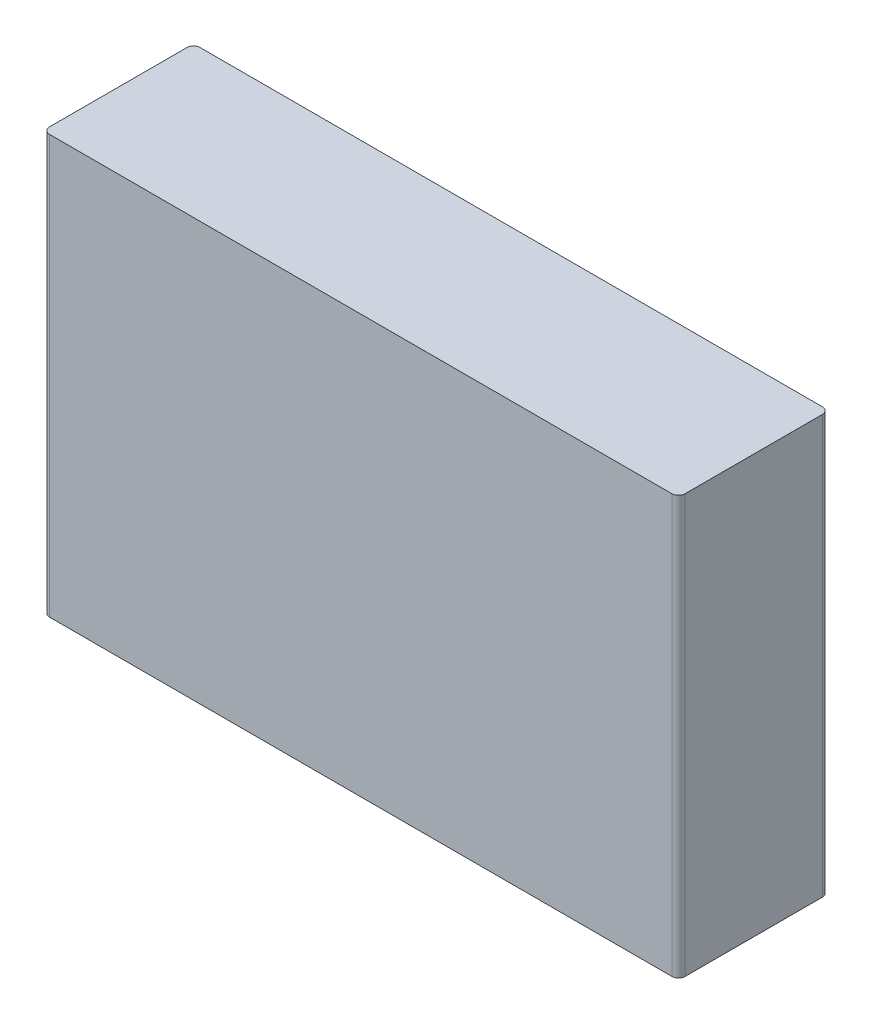
ISO-10303-21;
HEADER;
FILE_DESCRIPTION(('STEP AP214'),'2;1');
FILE_NAME('part.step','',(''),(''),'','','');
FILE_SCHEMA(('AUTOMOTIVE_DESIGN { 1 0 10303 214 1 1 1 1 }'));
ENDSEC;
DATA;
#1=APPLICATION_CONTEXT('core data for automotive mechanical design processes');
#2=APPLICATION_PROTOCOL_DEFINITION('international standard','automotive_design',2000,#1);
#3=PRODUCT_CONTEXT('',#1,'mechanical');
#4=PRODUCT('Part','Part','',(#3));
#5=PRODUCT_RELATED_PRODUCT_CATEGORY('part','',(#4));
#6=PRODUCT_DEFINITION_FORMATION('','',#4);
#7=PRODUCT_DEFINITION_CONTEXT('part definition',#1,'design');
#8=PRODUCT_DEFINITION('design','',#6,#7);
#9=PRODUCT_DEFINITION_SHAPE('','',#8);
#10=(LENGTH_UNIT() NAMED_UNIT(*) SI_UNIT(.MILLI.,.METRE.));
#11=(NAMED_UNIT(*) PLANE_ANGLE_UNIT() SI_UNIT($,.RADIAN.));
#12=(NAMED_UNIT(*) SI_UNIT($,.STERADIAN.) SOLID_ANGLE_UNIT());
#13=UNCERTAINTY_MEASURE_WITH_UNIT(LENGTH_MEASURE(1.E-05),#10,'distance_accuracy_value','');
#14=(GEOMETRIC_REPRESENTATION_CONTEXT(3) GLOBAL_UNCERTAINTY_ASSIGNED_CONTEXT((#13)) GLOBAL_UNIT_ASSIGNED_CONTEXT((#10,
#11,#12)) REPRESENTATION_CONTEXT('',''));
#15=CARTESIAN_POINT('',(0.,0.,0.));
#16=DIRECTION('',(0.,0.,1.));
#17=DIRECTION('',(1.,0.,0.));
#18=AXIS2_PLACEMENT_3D('',#15,#16,#17);
#19=CARTESIAN_POINT('',(0.93,-0.625,0.07));
#20=DIRECTION('',(0.,1.,0.));
#21=DIRECTION('',(0.707106781186548,0.,-0.707106781186547));
#22=AXIS2_PLACEMENT_3D('',#19,#20,#21);
#23=CYLINDRICAL_SURFACE('',#22,0.02);
#24=CARTESIAN_POINT('',(0.93,0.625,0.07));
#25=DIRECTION('',(0.,-1.,0.));
#26=DIRECTION('',(0.,0.,-1.));
#27=AXIS2_PLACEMENT_3D('',#24,#25,#26);
#28=CIRCLE('',#27,0.02);
#29=CARTESIAN_POINT('',(0.93,0.625,0.05));
#30=VERTEX_POINT('',#29);
#31=CARTESIAN_POINT('',(0.95,0.625,0.07));
#32=VERTEX_POINT('',#31);
#33=EDGE_CURVE('E11',#30,#32,#28,.T.);
#34=ORIENTED_EDGE('',*,*,#33,.T.);
#35=DIRECTION('',(0.,-1.,0.));
#36=VECTOR('',#35,1.);
#37=CARTESIAN_POINT('',(0.95,0.625,0.07));
#38=LINE('',#37,#36);
#39=CARTESIAN_POINT('',(0.95,-0.625,0.07));
#40=VERTEX_POINT('',#39);
#41=EDGE_CURVE('E136',#32,#40,#38,.T.);
#42=ORIENTED_EDGE('',*,*,#41,.T.);
#43=CARTESIAN_POINT('',(0.93,-0.625,0.07));
#44=DIRECTION('',(0.,1.,0.));
#45=DIRECTION('',(1.,0.,0.));
#46=AXIS2_PLACEMENT_3D('',#43,#44,#45);
#47=CIRCLE('',#46,0.02);
#48=CARTESIAN_POINT('',(0.93,-0.625,0.05));
#49=VERTEX_POINT('',#48);
#50=EDGE_CURVE('E24',#40,#49,#47,.T.);
#51=ORIENTED_EDGE('',*,*,#50,.T.);
#52=DIRECTION('',(0.,1.,0.));
#53=VECTOR('',#52,1.);
#54=CARTESIAN_POINT('',(0.93,-0.625,0.05));
#55=LINE('',#54,#53);
#56=EDGE_CURVE('E124',#49,#30,#55,.T.);
#57=ORIENTED_EDGE('',*,*,#56,.T.);
#58=EDGE_LOOP('',(#34,#42,#51,#57));
#59=FACE_BOUND('',#58,.T.);
#60=ADVANCED_FACE('F17',(#59),#23,.T.);
#61=CARTESIAN_POINT('',(-1.,-0.625,0.));
#62=DIRECTION('',(0.,-1.,0.));
#63=DIRECTION('',(1.,0.,0.));
#64=AXIS2_PLACEMENT_3D('',#61,#62,#63);
#65=PLANE('',#64);
#66=ORIENTED_EDGE('',*,*,#50,.F.);
#67=DIRECTION('',(0.,0.,-1.));
#68=VECTOR('',#67,1.);
#69=CARTESIAN_POINT('',(0.95,-0.625,0.48));
#70=LINE('',#69,#68);
#71=CARTESIAN_POINT('',(0.95,-0.625,0.48));
#72=VERTEX_POINT('',#71);
#73=EDGE_CURVE('E133',#72,#40,#70,.T.);
#74=ORIENTED_EDGE('',*,*,#73,.F.);
#75=CARTESIAN_POINT('',(0.93,-0.625,0.48));
#76=DIRECTION('',(0.,1.,0.));
#77=DIRECTION('',(0.,0.,1.));
#78=AXIS2_PLACEMENT_3D('',#75,#76,#77);
#79=CIRCLE('',#78,0.02);
#80=CARTESIAN_POINT('',(0.93,-0.625,0.5));
#81=VERTEX_POINT('',#80);
#82=EDGE_CURVE('E126',#81,#72,#79,.T.);
#83=ORIENTED_EDGE('',*,*,#82,.F.);
#84=DIRECTION('',(1.,0.,0.));
#85=VECTOR('',#84,1.);
#86=CARTESIAN_POINT('',(-0.93,-0.625,0.5));
#87=LINE('',#86,#85);
#88=CARTESIAN_POINT('',(-0.93,-0.625,0.5));
#89=VERTEX_POINT('',#88);
#90=EDGE_CURVE('E116',#89,#81,#87,.T.);
#91=ORIENTED_EDGE('',*,*,#90,.F.);
#92=CARTESIAN_POINT('',(-0.93,-0.625,0.48));
#93=DIRECTION('',(0.,1.,0.));
#94=DIRECTION('',(-1.,0.,0.));
#95=AXIS2_PLACEMENT_3D('',#92,#93,#94);
#96=CIRCLE('',#95,0.02);
#97=CARTESIAN_POINT('',(-0.95,-0.625,0.48));
#98=VERTEX_POINT('',#97);
#99=EDGE_CURVE('E97',#98,#89,#96,.T.);
#100=ORIENTED_EDGE('',*,*,#99,.F.);
#101=DIRECTION('',(0.,0.,1.));
#102=VECTOR('',#101,1.);
#103=CARTESIAN_POINT('',(-0.95,-0.625,0.07));
#104=LINE('',#103,#102);
#105=CARTESIAN_POINT('',(-0.95,-0.625,0.07));
#106=VERTEX_POINT('',#105);
#107=EDGE_CURVE('E104',#106,#98,#104,.T.);
#108=ORIENTED_EDGE('',*,*,#107,.F.);
#109=CARTESIAN_POINT('',(-0.93,-0.625,0.07));
#110=DIRECTION('',(0.,1.,0.));
#111=DIRECTION('',(0.,0.,-1.));
#112=AXIS2_PLACEMENT_3D('',#109,#110,#111);
#113=CIRCLE('',#112,0.02);
#114=CARTESIAN_POINT('',(-0.93,-0.625,0.05));
#115=VERTEX_POINT('',#114);
#116=EDGE_CURVE('E109',#115,#106,#113,.T.);
#117=ORIENTED_EDGE('',*,*,#116,.F.);
#118=DIRECTION('',(-1.,0.,0.));
#119=VECTOR('',#118,1.);
#120=CARTESIAN_POINT('',(0.93,-0.625,0.05));
#121=LINE('',#120,#119);
#122=EDGE_CURVE('E143',#49,#115,#121,.T.);
#123=ORIENTED_EDGE('',*,*,#122,.F.);
#124=EDGE_LOOP('',(#66,#74,#83,#91,#100,#108,#117,#123));
#125=FACE_BOUND('',#124,.T.);
#126=ADVANCED_FACE('F146',(#125),#65,.T.);
#127=CARTESIAN_POINT('',(0.95,-0.625,0.5));
#128=DIRECTION('',(1.,0.,0.));
#129=DIRECTION('',(0.,0.,-1.));
#130=AXIS2_PLACEMENT_3D('',#127,#128,#129);
#131=PLANE('',#130);
#132=ORIENTED_EDGE('',*,*,#41,.F.);
#133=DIRECTION('',(0.,0.,1.));
#134=VECTOR('',#133,1.);
#135=CARTESIAN_POINT('',(0.95,0.625,0.07));
#136=LINE('',#135,#134);
#137=CARTESIAN_POINT('',(0.95,0.625,0.48));
#138=VERTEX_POINT('',#137);
#139=EDGE_CURVE('E129',#32,#138,#136,.T.);
#140=ORIENTED_EDGE('',*,*,#139,.T.);
#141=DIRECTION('',(0.,1.,0.));
#142=VECTOR('',#141,1.);
#143=CARTESIAN_POINT('',(0.95,-0.625,0.48));
#144=LINE('',#143,#142);
#145=EDGE_CURVE('E118',#72,#138,#144,.T.);
#146=ORIENTED_EDGE('',*,*,#145,.F.);
#147=ORIENTED_EDGE('',*,*,#73,.T.);
#148=EDGE_LOOP('',(#132,#140,#146,#147));
#149=FACE_BOUND('',#148,.T.);
#150=ADVANCED_FACE('F161',(#149),#131,.T.);
#151=CARTESIAN_POINT('',(0.93,-0.625,0.48));
#152=DIRECTION('',(0.,1.,0.));
#153=DIRECTION('',(0.707106781186548,0.,0.707106781186548));
#154=AXIS2_PLACEMENT_3D('',#151,#152,#153);
#155=CYLINDRICAL_SURFACE('',#154,0.02);
#156=CARTESIAN_POINT('',(0.93,0.625,0.48));
#157=DIRECTION('',(0.,-1.,0.));
#158=DIRECTION('',(1.,0.,0.));
#159=AXIS2_PLACEMENT_3D('',#156,#157,#158);
#160=CIRCLE('',#159,0.02);
#161=CARTESIAN_POINT('',(0.93,0.625,0.5));
#162=VERTEX_POINT('',#161);
#163=EDGE_CURVE('E131',#138,#162,#160,.T.);
#164=ORIENTED_EDGE('',*,*,#163,.T.);
#165=DIRECTION('',(0.,-1.,0.));
#166=VECTOR('',#165,1.);
#167=CARTESIAN_POINT('',(0.93,0.625,0.5));
#168=LINE('',#167,#166);
#169=EDGE_CURVE('E85',#162,#81,#168,.T.);
#170=ORIENTED_EDGE('',*,*,#169,.T.);
#171=ORIENTED_EDGE('',*,*,#82,.T.);
#172=ORIENTED_EDGE('',*,*,#145,.T.);
#173=EDGE_LOOP('',(#164,#170,#171,#172));
#174=FACE_BOUND('',#173,.T.);
#175=ADVANCED_FACE('F163',(#174),#155,.T.);
#176=CARTESIAN_POINT('',(-0.93,-0.625,0.07));
#177=DIRECTION('',(0.,1.,0.));
#178=DIRECTION('',(-0.707106781186548,0.,-0.707106781186547));
#179=AXIS2_PLACEMENT_3D('',#176,#177,#178);
#180=CYLINDRICAL_SURFACE('',#179,0.02);
#181=CARTESIAN_POINT('',(-0.93,0.625,0.07));
#182=DIRECTION('',(0.,-1.,0.));
#183=DIRECTION('',(-1.,0.,0.));
#184=AXIS2_PLACEMENT_3D('',#181,#182,#183);
#185=CIRCLE('',#184,0.02);
#186=CARTESIAN_POINT('',(-0.95,0.625,0.07));
#187=VERTEX_POINT('',#186);
#188=CARTESIAN_POINT('',(-0.93,0.625,0.05));
#189=VERTEX_POINT('',#188);
#190=EDGE_CURVE('E122',#187,#189,#185,.T.);
#191=ORIENTED_EDGE('',*,*,#190,.T.);
#192=DIRECTION('',(0.,-1.,0.));
#193=VECTOR('',#192,1.);
#194=CARTESIAN_POINT('',(-0.93,0.625,0.05));
#195=LINE('',#194,#193);
#196=EDGE_CURVE('E106',#189,#115,#195,.T.);
#197=ORIENTED_EDGE('',*,*,#196,.T.);
#198=ORIENTED_EDGE('',*,*,#116,.T.);
#199=DIRECTION('',(0.,1.,0.));
#200=VECTOR('',#199,1.);
#201=CARTESIAN_POINT('',(-0.95,-0.625,0.07));
#202=LINE('',#201,#200);
#203=EDGE_CURVE('E114',#106,#187,#202,.T.);
#204=ORIENTED_EDGE('',*,*,#203,.T.);
#205=EDGE_LOOP('',(#191,#197,#198,#204));
#206=FACE_BOUND('',#205,.T.);
#207=ADVANCED_FACE('F154',(#206),#180,.T.);
#208=CARTESIAN_POINT('',(-0.95,-0.625,0.05));
#209=DIRECTION('',(-1.,0.,0.));
#210=DIRECTION('',(0.,0.,1.));
#211=AXIS2_PLACEMENT_3D('',#208,#209,#210);
#212=PLANE('',#211);
#213=ORIENTED_EDGE('',*,*,#203,.F.);
#214=ORIENTED_EDGE('',*,*,#107,.T.);
#215=DIRECTION('',(0.,-1.,0.));
#216=VECTOR('',#215,1.);
#217=CARTESIAN_POINT('',(-0.95,0.625,0.48));
#218=LINE('',#217,#216);
#219=CARTESIAN_POINT('',(-0.95,0.625,0.48));
#220=VERTEX_POINT('',#219);
#221=EDGE_CURVE('E149',#220,#98,#218,.T.);
#222=ORIENTED_EDGE('',*,*,#221,.F.);
#223=DIRECTION('',(0.,0.,-1.));
#224=VECTOR('',#223,1.);
#225=CARTESIAN_POINT('',(-0.95,0.625,0.48));
#226=LINE('',#225,#224);
#227=EDGE_CURVE('E89',#220,#187,#226,.T.);
#228=ORIENTED_EDGE('',*,*,#227,.T.);
#229=EDGE_LOOP('',(#213,#214,#222,#228));
#230=FACE_BOUND('',#229,.T.);
#231=ADVANCED_FACE('F156',(#230),#212,.T.);
#232=CARTESIAN_POINT('',(-0.93,-0.625,0.48));
#233=DIRECTION('',(0.,1.,0.));
#234=DIRECTION('',(-0.707106781186548,0.,0.707106781186548));
#235=AXIS2_PLACEMENT_3D('',#232,#233,#234);
#236=CYLINDRICAL_SURFACE('',#235,0.02);
#237=CARTESIAN_POINT('',(-0.93,0.625,0.48));
#238=DIRECTION('',(0.,-1.,0.));
#239=DIRECTION('',(0.,0.,1.));
#240=AXIS2_PLACEMENT_3D('',#237,#238,#239);
#241=CIRCLE('',#240,0.02);
#242=CARTESIAN_POINT('',(-0.93,0.625,0.5));
#243=VERTEX_POINT('',#242);
#244=EDGE_CURVE('E95',#243,#220,#241,.T.);
#245=ORIENTED_EDGE('',*,*,#244,.T.);
#246=ORIENTED_EDGE('',*,*,#221,.T.);
#247=ORIENTED_EDGE('',*,*,#99,.T.);
#248=DIRECTION('',(0.,1.,0.));
#249=VECTOR('',#248,1.);
#250=CARTESIAN_POINT('',(-0.93,-0.625,0.5));
#251=LINE('',#250,#249);
#252=EDGE_CURVE('E83',#89,#243,#251,.T.);
#253=ORIENTED_EDGE('',*,*,#252,.T.);
#254=EDGE_LOOP('',(#245,#246,#247,#253));
#255=FACE_BOUND('',#254,.T.);
#256=ADVANCED_FACE('F93',(#255),#236,.T.);
#257=CARTESIAN_POINT('',(0.95,-0.625,0.05));
#258=DIRECTION('',(0.,0.,-1.));
#259=DIRECTION('',(-1.,0.,0.));
#260=AXIS2_PLACEMENT_3D('',#257,#258,#259);
#261=PLANE('',#260);
#262=ORIENTED_EDGE('',*,*,#56,.F.);
#263=ORIENTED_EDGE('',*,*,#122,.T.);
#264=ORIENTED_EDGE('',*,*,#196,.F.);
#265=DIRECTION('',(1.,0.,0.));
#266=VECTOR('',#265,1.);
#267=CARTESIAN_POINT('',(-0.930000000000001,0.625,0.05));
#268=LINE('',#267,#266);
#269=EDGE_CURVE('E98',#189,#30,#268,.T.);
#270=ORIENTED_EDGE('',*,*,#269,.T.);
#271=EDGE_LOOP('',(#262,#263,#264,#270));
#272=FACE_BOUND('',#271,.T.);
#273=ADVANCED_FACE('F141',(#272),#261,.T.);
#274=CARTESIAN_POINT('',(-0.95,-0.625,0.5));
#275=DIRECTION('',(0.,0.,1.));
#276=DIRECTION('',(1.,0.,0.));
#277=AXIS2_PLACEMENT_3D('',#274,#275,#276);
#278=PLANE('',#277);
#279=ORIENTED_EDGE('',*,*,#169,.F.);
#280=DIRECTION('',(-1.,0.,0.));
#281=VECTOR('',#280,1.);
#282=CARTESIAN_POINT('',(0.93,0.625,0.5));
#283=LINE('',#282,#281);
#284=EDGE_CURVE('E79',#162,#243,#283,.T.);
#285=ORIENTED_EDGE('',*,*,#284,.T.);
#286=ORIENTED_EDGE('',*,*,#252,.F.);
#287=ORIENTED_EDGE('',*,*,#90,.T.);
#288=EDGE_LOOP('',(#279,#285,#286,#287));
#289=FACE_BOUND('',#288,.T.);
#290=ADVANCED_FACE('F81',(#289),#278,.T.);
#291=CARTESIAN_POINT('',(1.,0.625,0.));
#292=DIRECTION('',(0.,1.,0.));
#293=DIRECTION('',(-1.,0.,0.));
#294=AXIS2_PLACEMENT_3D('',#291,#292,#293);
#295=PLANE('',#294);
#296=ORIENTED_EDGE('',*,*,#33,.F.);
#297=ORIENTED_EDGE('',*,*,#269,.F.);
#298=ORIENTED_EDGE('',*,*,#190,.F.);
#299=ORIENTED_EDGE('',*,*,#227,.F.);
#300=ORIENTED_EDGE('',*,*,#244,.F.);
#301=ORIENTED_EDGE('',*,*,#284,.F.);
#302=ORIENTED_EDGE('',*,*,#163,.F.);
#303=ORIENTED_EDGE('',*,*,#139,.F.);
#304=EDGE_LOOP('',(#296,#297,#298,#299,#300,#301,#302,#303));
#305=FACE_BOUND('',#304,.T.);
#306=ADVANCED_FACE('F101',(#305),#295,.T.);
#307=CLOSED_SHELL('',(#60,#126,#150,#175,#207,#231,#256,#273,#290,#306));
#308=MANIFOLD_SOLID_BREP('B1',#307);
#309=ADVANCED_BREP_SHAPE_REPRESENTATION('',(#18,#308),#14);
#310=SHAPE_DEFINITION_REPRESENTATION(#9,#309);
ENDSEC;
END-ISO-10303-21;
